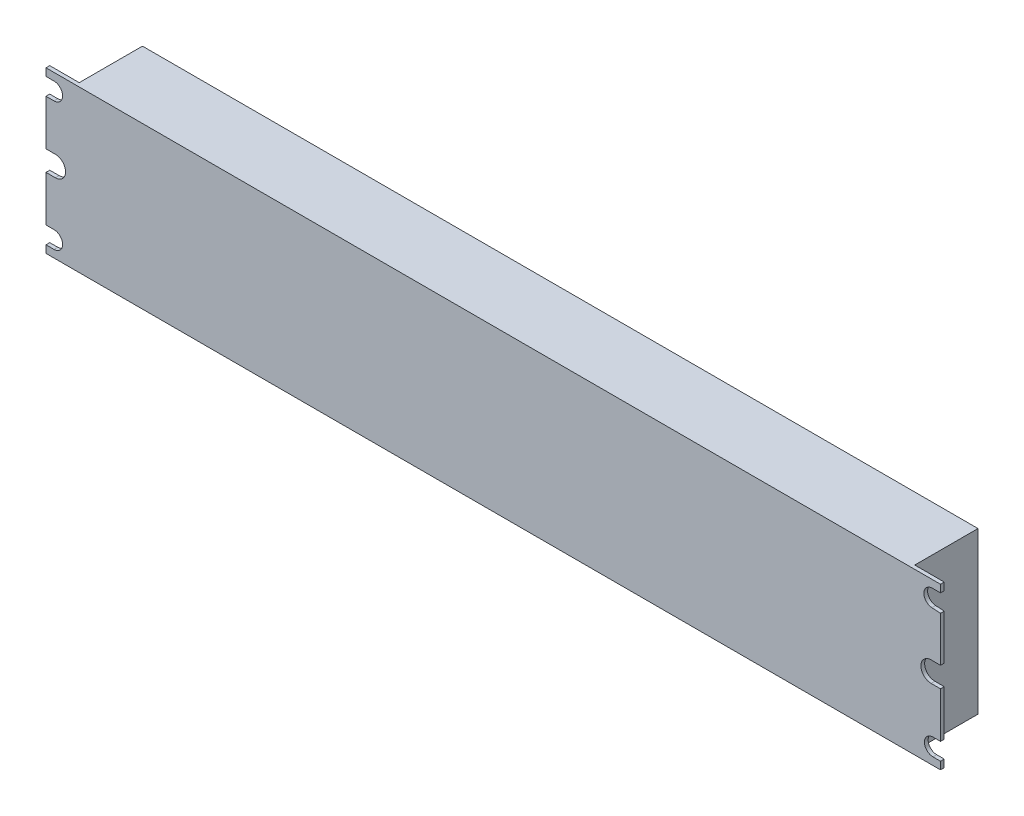
ISO-10303-21;
HEADER;
FILE_DESCRIPTION(('STEP AP214'),'2;1');
FILE_NAME('part.step','',(''),(''),'','','');
FILE_SCHEMA(('AUTOMOTIVE_DESIGN { 1 0 10303 214 1 1 1 1 }'));
ENDSEC;
DATA;
#1=APPLICATION_CONTEXT('core data for automotive mechanical design processes');
#2=APPLICATION_PROTOCOL_DEFINITION('international standard','automotive_design',2000,#1);
#3=PRODUCT_CONTEXT('',#1,'mechanical');
#4=PRODUCT('Part','Part','',(#3));
#5=PRODUCT_RELATED_PRODUCT_CATEGORY('part','',(#4));
#6=PRODUCT_DEFINITION_FORMATION('','',#4);
#7=PRODUCT_DEFINITION_CONTEXT('part definition',#1,'design');
#8=PRODUCT_DEFINITION('design','',#6,#7);
#9=PRODUCT_DEFINITION_SHAPE('','',#8);
#10=(LENGTH_UNIT() NAMED_UNIT(*) SI_UNIT(.MILLI.,.METRE.));
#11=(NAMED_UNIT(*) PLANE_ANGLE_UNIT() SI_UNIT($,.RADIAN.));
#12=(NAMED_UNIT(*) SI_UNIT($,.STERADIAN.) SOLID_ANGLE_UNIT());
#13=UNCERTAINTY_MEASURE_WITH_UNIT(LENGTH_MEASURE(1.E-05),#10,'distance_accuracy_value','');
#14=(GEOMETRIC_REPRESENTATION_CONTEXT(3) GLOBAL_UNCERTAINTY_ASSIGNED_CONTEXT((#13)) GLOBAL_UNIT_ASSIGNED_CONTEXT((#10,
#11,#12)) REPRESENTATION_CONTEXT('',''));
#15=CARTESIAN_POINT('',(0.,0.,0.));
#16=DIRECTION('',(0.,0.,1.));
#17=DIRECTION('',(1.,0.,0.));
#18=AXIS2_PLACEMENT_3D('',#15,#16,#17);
#19=CARTESIAN_POINT('',(419.481,38.1,414.782));
#20=DIRECTION('',(0.,0.,-1.));
#21=DIRECTION('',(-1.,0.,0.));
#22=AXIS2_PLACEMENT_3D('',#19,#20,#21);
#23=CYLINDRICAL_SURFACE('',#22,4.82600000000005);
#24=DIRECTION('',(0.,0.,-1.));
#25=VECTOR('',#24,1.);
#26=CARTESIAN_POINT('',(419.481,33.274,0.));
#27=LINE('',#26,#25);
#28=CARTESIAN_POINT('',(419.481,33.274,0.));
#29=VERTEX_POINT('',#28);
#30=CARTESIAN_POINT('',(419.481,33.274,-1.778));
#31=VERTEX_POINT('',#30);
#32=EDGE_CURVE('E531',#29,#31,#27,.T.);
#33=ORIENTED_EDGE('',*,*,#32,.T.);
#34=CARTESIAN_POINT('',(419.481,38.1,-1.778));
#35=DIRECTION('',(0.,0.,-1.));
#36=DIRECTION('',(-1.,0.,0.));
#37=AXIS2_PLACEMENT_3D('',#34,#35,#36);
#38=CIRCLE('',#37,4.82600000000005);
#39=CARTESIAN_POINT('',(419.481,42.926,-1.778));
#40=VERTEX_POINT('',#39);
#41=EDGE_CURVE('E286',#31,#40,#38,.T.);
#42=ORIENTED_EDGE('',*,*,#41,.T.);
#43=DIRECTION('',(0.,0.,-1.));
#44=VECTOR('',#43,1.);
#45=CARTESIAN_POINT('',(419.481,42.926,0.));
#46=LINE('',#45,#44);
#47=CARTESIAN_POINT('',(419.481,42.926,0.));
#48=VERTEX_POINT('',#47);
#49=EDGE_CURVE('E528',#48,#40,#46,.T.);
#50=ORIENTED_EDGE('',*,*,#49,.F.);
#51=CARTESIAN_POINT('',(419.481,38.1,0.));
#52=DIRECTION('',(0.,0.,-1.));
#53=DIRECTION('',(-1.,0.,0.));
#54=AXIS2_PLACEMENT_3D('',#51,#52,#53);
#55=CIRCLE('',#54,4.82600000000005);
#56=EDGE_CURVE('E342',#29,#48,#55,.T.);
#57=ORIENTED_EDGE('',*,*,#56,.F.);
#58=EDGE_LOOP('',(#33,#42,#50,#57));
#59=FACE_BOUND('',#58,.T.);
#60=ADVANCED_FACE('F41',(#59),#23,.F.);
#61=CARTESIAN_POINT('',(420.37,7.62,414.782));
#62=DIRECTION('',(0.,0.,-1.));
#63=DIRECTION('',(-1.,0.,0.));
#64=AXIS2_PLACEMENT_3D('',#61,#62,#63);
#65=CYLINDRICAL_SURFACE('',#64,4.06400000000002);
#66=DIRECTION('',(0.,0.,-1.));
#67=VECTOR('',#66,1.);
#68=CARTESIAN_POINT('',(420.37,3.55599999999998,0.));
#69=LINE('',#68,#67);
#70=CARTESIAN_POINT('',(420.37,3.55599999999998,0.));
#71=VERTEX_POINT('',#70);
#72=CARTESIAN_POINT('',(420.37,3.55599999999998,-1.778));
#73=VERTEX_POINT('',#72);
#74=EDGE_CURVE('E300',#71,#73,#69,.T.);
#75=ORIENTED_EDGE('',*,*,#74,.T.);
#76=CARTESIAN_POINT('',(420.37,7.62,-1.778));
#77=DIRECTION('',(0.,0.,-1.));
#78=DIRECTION('',(-1.,0.,0.));
#79=AXIS2_PLACEMENT_3D('',#76,#77,#78);
#80=CIRCLE('',#79,4.06400000000002);
#81=CARTESIAN_POINT('',(420.37,11.684,-1.778));
#82=VERTEX_POINT('',#81);
#83=EDGE_CURVE('E49',#73,#82,#80,.T.);
#84=ORIENTED_EDGE('',*,*,#83,.T.);
#85=DIRECTION('',(0.,0.,-1.));
#86=VECTOR('',#85,1.);
#87=CARTESIAN_POINT('',(420.37,11.684,0.));
#88=LINE('',#87,#86);
#89=CARTESIAN_POINT('',(420.37,11.684,0.));
#90=VERTEX_POINT('',#89);
#91=EDGE_CURVE('E298',#90,#82,#88,.T.);
#92=ORIENTED_EDGE('',*,*,#91,.F.);
#93=CARTESIAN_POINT('',(420.37,7.62,0.));
#94=DIRECTION('',(0.,0.,-1.));
#95=DIRECTION('',(-1.,0.,0.));
#96=AXIS2_PLACEMENT_3D('',#93,#94,#95);
#97=CIRCLE('',#96,4.06400000000002);
#98=EDGE_CURVE('E347',#71,#90,#97,.T.);
#99=ORIENTED_EDGE('',*,*,#98,.F.);
#100=EDGE_LOOP('',(#75,#84,#92,#99));
#101=FACE_BOUND('',#100,.T.);
#102=ADVANCED_FACE('F296',(#101),#65,.F.);
#103=CARTESIAN_POINT('',(3.80999999999994,7.62,414.782));
#104=DIRECTION('',(0.,0.,-1.));
#105=DIRECTION('',(-1.,0.,0.));
#106=AXIS2_PLACEMENT_3D('',#103,#104,#105);
#107=CYLINDRICAL_SURFACE('',#106,4.064);
#108=DIRECTION('',(0.,0.,-1.));
#109=VECTOR('',#108,1.);
#110=CARTESIAN_POINT('',(3.80999999999996,11.684,0.));
#111=LINE('',#110,#109);
#112=CARTESIAN_POINT('',(3.80999999999996,11.684,0.));
#113=VERTEX_POINT('',#112);
#114=CARTESIAN_POINT('',(3.80999999999996,11.684,-1.778));
#115=VERTEX_POINT('',#114);
#116=EDGE_CURVE('E479',#113,#115,#111,.T.);
#117=ORIENTED_EDGE('',*,*,#116,.T.);
#118=CARTESIAN_POINT('',(3.80999999999994,7.62,-1.778));
#119=DIRECTION('',(0.,0.,-1.));
#120=DIRECTION('',(-1.,0.,0.));
#121=AXIS2_PLACEMENT_3D('',#118,#119,#120);
#122=CIRCLE('',#121,4.064);
#123=CARTESIAN_POINT('',(3.8099999999999,3.556,-1.778));
#124=VERTEX_POINT('',#123);
#125=EDGE_CURVE('E337',#115,#124,#122,.T.);
#126=ORIENTED_EDGE('',*,*,#125,.T.);
#127=DIRECTION('',(0.,0.,-1.));
#128=VECTOR('',#127,1.);
#129=CARTESIAN_POINT('',(3.8099999999999,3.556,0.));
#130=LINE('',#129,#128);
#131=CARTESIAN_POINT('',(3.80999999999996,3.556,0.));
#132=VERTEX_POINT('',#131);
#133=EDGE_CURVE('E475',#132,#124,#130,.T.);
#134=ORIENTED_EDGE('',*,*,#133,.F.);
#135=CARTESIAN_POINT('',(3.80999999999994,7.62,0.));
#136=DIRECTION('',(0.,0.,-1.));
#137=DIRECTION('',(-1.,0.,0.));
#138=AXIS2_PLACEMENT_3D('',#135,#136,#137);
#139=CIRCLE('',#138,4.064);
#140=EDGE_CURVE('E349',#113,#132,#139,.T.);
#141=ORIENTED_EDGE('',*,*,#140,.F.);
#142=EDGE_LOOP('',(#117,#126,#134,#141));
#143=FACE_BOUND('',#142,.T.);
#144=ADVANCED_FACE('F566',(#143),#107,.F.);
#145=CARTESIAN_POINT('',(4.44499999999994,38.1,414.782));
#146=DIRECTION('',(0.,0.,-1.));
#147=DIRECTION('',(-1.,0.,0.));
#148=AXIS2_PLACEMENT_3D('',#145,#146,#147);
#149=CYLINDRICAL_SURFACE('',#148,4.826);
#150=DIRECTION('',(0.,0.,-1.));
#151=VECTOR('',#150,1.);
#152=CARTESIAN_POINT('',(4.44499999999996,42.926,0.));
#153=LINE('',#152,#151);
#154=CARTESIAN_POINT('',(4.44499999999996,42.926,0.));
#155=VERTEX_POINT('',#154);
#156=CARTESIAN_POINT('',(4.44499999999999,42.926,-1.778));
#157=VERTEX_POINT('',#156);
#158=EDGE_CURVE('E492',#155,#157,#153,.T.);
#159=ORIENTED_EDGE('',*,*,#158,.T.);
#160=CARTESIAN_POINT('',(4.44499999999994,38.1,-1.778));
#161=DIRECTION('',(0.,0.,-1.));
#162=DIRECTION('',(-1.,0.,0.));
#163=AXIS2_PLACEMENT_3D('',#160,#161,#162);
#164=CIRCLE('',#163,4.826);
#165=CARTESIAN_POINT('',(4.44499999999989,33.274,-1.778));
#166=VERTEX_POINT('',#165);
#167=EDGE_CURVE('E333',#157,#166,#164,.T.);
#168=ORIENTED_EDGE('',*,*,#167,.T.);
#169=DIRECTION('',(0.,0.,-1.));
#170=VECTOR('',#169,1.);
#171=CARTESIAN_POINT('',(4.44499999999989,33.274,0.));
#172=LINE('',#171,#170);
#173=CARTESIAN_POINT('',(4.445,33.274,0.));
#174=VERTEX_POINT('',#173);
#175=EDGE_CURVE('E261',#174,#166,#172,.T.);
#176=ORIENTED_EDGE('',*,*,#175,.F.);
#177=CARTESIAN_POINT('',(4.44499999999994,38.1,0.));
#178=DIRECTION('',(0.,0.,-1.));
#179=DIRECTION('',(-1.,0.,0.));
#180=AXIS2_PLACEMENT_3D('',#177,#178,#179);
#181=CIRCLE('',#180,4.826);
#182=EDGE_CURVE('E272',#155,#174,#181,.T.);
#183=ORIENTED_EDGE('',*,*,#182,.F.);
#184=EDGE_LOOP('',(#159,#168,#176,#183));
#185=FACE_BOUND('',#184,.T.);
#186=ADVANCED_FACE('F576',(#185),#149,.F.);
#187=CARTESIAN_POINT('',(3.80999999999994,68.58,414.782));
#188=DIRECTION('',(0.,0.,-1.));
#189=DIRECTION('',(-1.,0.,0.));
#190=AXIS2_PLACEMENT_3D('',#187,#188,#189);
#191=CYLINDRICAL_SURFACE('',#190,4.06399999999999);
#192=DIRECTION('',(0.,0.,-1.));
#193=VECTOR('',#192,1.);
#194=CARTESIAN_POINT('',(3.80999999999985,72.644,0.));
#195=LINE('',#194,#193);
#196=CARTESIAN_POINT('',(3.80999999999985,72.644,0.));
#197=VERTEX_POINT('',#196);
#198=CARTESIAN_POINT('',(3.80999999999994,72.644,-1.778));
#199=VERTEX_POINT('',#198);
#200=EDGE_CURVE('E506',#197,#199,#195,.T.);
#201=ORIENTED_EDGE('',*,*,#200,.T.);
#202=CARTESIAN_POINT('',(3.80999999999994,68.58,-1.778));
#203=DIRECTION('',(0.,0.,-1.));
#204=DIRECTION('',(-1.,0.,0.));
#205=AXIS2_PLACEMENT_3D('',#202,#203,#204);
#206=CIRCLE('',#205,4.06399999999999);
#207=CARTESIAN_POINT('',(3.81,64.516,-1.778));
#208=VERTEX_POINT('',#207);
#209=EDGE_CURVE('E334',#199,#208,#206,.T.);
#210=ORIENTED_EDGE('',*,*,#209,.T.);
#211=DIRECTION('',(0.,0.,-1.));
#212=VECTOR('',#211,1.);
#213=CARTESIAN_POINT('',(3.81,64.516,0.));
#214=LINE('',#213,#212);
#215=CARTESIAN_POINT('',(3.80999999999994,64.516,0.));
#216=VERTEX_POINT('',#215);
#217=EDGE_CURVE('E489',#216,#208,#214,.T.);
#218=ORIENTED_EDGE('',*,*,#217,.F.);
#219=CARTESIAN_POINT('',(3.80999999999994,68.58,0.));
#220=DIRECTION('',(0.,0.,-1.));
#221=DIRECTION('',(-1.,0.,0.));
#222=AXIS2_PLACEMENT_3D('',#219,#220,#221);
#223=CIRCLE('',#222,4.06399999999999);
#224=EDGE_CURVE('E353',#197,#216,#223,.T.);
#225=ORIENTED_EDGE('',*,*,#224,.F.);
#226=EDGE_LOOP('',(#201,#210,#218,#225));
#227=FACE_BOUND('',#226,.T.);
#228=ADVANCED_FACE('F572',(#227),#191,.F.);
#229=CARTESIAN_POINT('',(0.,76.2,0.));
#230=DIRECTION('',(1.,0.,0.));
#231=DIRECTION('',(0.,0.,-1.));
#232=AXIS2_PLACEMENT_3D('',#229,#230,#231);
#233=PLANE('',#232);
#234=DIRECTION('',(0.,-1.,0.));
#235=VECTOR('',#234,1.);
#236=CARTESIAN_POINT('',(0.,76.2,0.));
#237=LINE('',#236,#235);
#238=CARTESIAN_POINT('',(0.,64.516,0.));
#239=VERTEX_POINT('',#238);
#240=CARTESIAN_POINT('',(0.,42.926,0.));
#241=VERTEX_POINT('',#240);
#242=EDGE_CURVE('E277',#239,#241,#237,.T.);
#243=ORIENTED_EDGE('',*,*,#242,.F.);
#244=DIRECTION('',(0.,0.,-1.));
#245=VECTOR('',#244,1.);
#246=CARTESIAN_POINT('',(0.,64.516,0.));
#247=LINE('',#246,#245);
#248=CARTESIAN_POINT('',(0.,64.516,-1.778));
#249=VERTEX_POINT('',#248);
#250=EDGE_CURVE('E493',#239,#249,#247,.T.);
#251=ORIENTED_EDGE('',*,*,#250,.T.);
#252=DIRECTION('',(0.,1.,0.));
#253=VECTOR('',#252,1.);
#254=CARTESIAN_POINT('',(0.,0.,-1.778));
#255=LINE('',#254,#253);
#256=CARTESIAN_POINT('',(0.,42.926,-1.778));
#257=VERTEX_POINT('',#256);
#258=EDGE_CURVE('E384',#257,#249,#255,.T.);
#259=ORIENTED_EDGE('',*,*,#258,.F.);
#260=DIRECTION('',(0.,0.,-1.));
#261=VECTOR('',#260,1.);
#262=CARTESIAN_POINT('',(0.,42.926,0.));
#263=LINE('',#262,#261);
#264=EDGE_CURVE('E499',#241,#257,#263,.T.);
#265=ORIENTED_EDGE('',*,*,#264,.F.);
#266=EDGE_LOOP('',(#243,#251,#259,#265));
#267=FACE_BOUND('',#266,.T.);
#268=ADVANCED_FACE('F575',(#267),#233,.F.);
#269=CARTESIAN_POINT('',(0.,33.2739999999999,0.));
#270=VERTEX_POINT('',#269);
#271=CARTESIAN_POINT('',(0.,11.684,0.));
#272=VERTEX_POINT('',#271);
#273=EDGE_CURVE('E269',#270,#272,#237,.T.);
#274=ORIENTED_EDGE('',*,*,#273,.F.);
#275=DIRECTION('',(0.,0.,-1.));
#276=VECTOR('',#275,1.);
#277=CARTESIAN_POINT('',(0.,33.2739999999999,0.));
#278=LINE('',#277,#276);
#279=CARTESIAN_POINT('',(0.,33.2739999999999,-1.778));
#280=VERTEX_POINT('',#279);
#281=EDGE_CURVE('E249',#270,#280,#278,.T.);
#282=ORIENTED_EDGE('',*,*,#281,.T.);
#283=CARTESIAN_POINT('',(0.,11.684,-1.778));
#284=VERTEX_POINT('',#283);
#285=EDGE_CURVE('E383',#284,#280,#255,.T.);
#286=ORIENTED_EDGE('',*,*,#285,.F.);
#287=DIRECTION('',(0.,0.,-1.));
#288=VECTOR('',#287,1.);
#289=CARTESIAN_POINT('',(0.,11.684,0.));
#290=LINE('',#289,#288);
#291=EDGE_CURVE('E276',#272,#284,#290,.T.);
#292=ORIENTED_EDGE('',*,*,#291,.F.);
#293=EDGE_LOOP('',(#274,#282,#286,#292));
#294=FACE_BOUND('',#293,.T.);
#295=ADVANCED_FACE('F275',(#294),#233,.F.);
#296=CARTESIAN_POINT('',(0.,3.55599999999998,0.));
#297=VERTEX_POINT('',#296);
#298=CARTESIAN_POINT('',(0.,0.,0.));
#299=VERTEX_POINT('',#298);
#300=EDGE_CURVE('E278',#297,#299,#237,.T.);
#301=ORIENTED_EDGE('',*,*,#300,.F.);
#302=DIRECTION('',(0.,0.,-1.));
#303=VECTOR('',#302,1.);
#304=CARTESIAN_POINT('',(0.,3.55599999999998,0.));
#305=LINE('',#304,#303);
#306=CARTESIAN_POINT('',(0.,3.55599999999998,-1.778));
#307=VERTEX_POINT('',#306);
#308=EDGE_CURVE('E454',#297,#307,#305,.T.);
#309=ORIENTED_EDGE('',*,*,#308,.T.);
#310=CARTESIAN_POINT('',(0.,0.,-1.778));
#311=VERTEX_POINT('',#310);
#312=EDGE_CURVE('E379',#311,#307,#255,.T.);
#313=ORIENTED_EDGE('',*,*,#312,.F.);
#314=DIRECTION('',(0.,0.,1.));
#315=VECTOR('',#314,1.);
#316=CARTESIAN_POINT('',(0.,0.,0.));
#317=LINE('',#316,#315);
#318=EDGE_CURVE('E377',#311,#299,#317,.T.);
#319=ORIENTED_EDGE('',*,*,#318,.T.);
#320=EDGE_LOOP('',(#301,#309,#313,#319));
#321=FACE_BOUND('',#320,.T.);
#322=ADVANCED_FACE('F452',(#321),#233,.F.);
#323=CARTESIAN_POINT('',(423.926,76.2,0.));
#324=DIRECTION('',(-1.,0.,0.));
#325=DIRECTION('',(0.,0.,1.));
#326=AXIS2_PLACEMENT_3D('',#323,#324,#325);
#327=PLANE('',#326);
#328=DIRECTION('',(0.,-1.,0.));
#329=VECTOR('',#328,1.);
#330=CARTESIAN_POINT('',(423.926,76.2,0.));
#331=LINE('',#330,#329);
#332=CARTESIAN_POINT('',(423.926,33.274,0.));
#333=VERTEX_POINT('',#332);
#334=CARTESIAN_POINT('',(423.926,11.684,0.));
#335=VERTEX_POINT('',#334);
#336=EDGE_CURVE('E447',#333,#335,#331,.T.);
#337=ORIENTED_EDGE('',*,*,#336,.T.);
#338=DIRECTION('',(0.,0.,-1.));
#339=VECTOR('',#338,1.);
#340=CARTESIAN_POINT('',(423.926,11.684,0.));
#341=LINE('',#340,#339);
#342=CARTESIAN_POINT('',(423.926,11.684,-1.778));
#343=VERTEX_POINT('',#342);
#344=EDGE_CURVE('E321',#335,#343,#341,.T.);
#345=ORIENTED_EDGE('',*,*,#344,.T.);
#346=DIRECTION('',(0.,-1.,0.));
#347=VECTOR('',#346,1.);
#348=CARTESIAN_POINT('',(423.926,76.2,-1.778));
#349=LINE('',#348,#347);
#350=CARTESIAN_POINT('',(423.926,33.274,-1.778));
#351=VERTEX_POINT('',#350);
#352=EDGE_CURVE('E310',#351,#343,#349,.T.);
#353=ORIENTED_EDGE('',*,*,#352,.F.);
#354=DIRECTION('',(0.,0.,-1.));
#355=VECTOR('',#354,1.);
#356=CARTESIAN_POINT('',(423.926,33.274,0.));
#357=LINE('',#356,#355);
#358=EDGE_CURVE('E538',#333,#351,#357,.T.);
#359=ORIENTED_EDGE('',*,*,#358,.F.);
#360=EDGE_LOOP('',(#337,#345,#353,#359));
#361=FACE_BOUND('',#360,.T.);
#362=ADVANCED_FACE('F547',(#361),#327,.F.);
#363=CARTESIAN_POINT('',(423.926,76.2,0.));
#364=VERTEX_POINT('',#363);
#365=CARTESIAN_POINT('',(423.926,72.6360547333585,0.));
#366=VERTEX_POINT('',#365);
#367=EDGE_CURVE('E282',#364,#366,#331,.T.);
#368=ORIENTED_EDGE('',*,*,#367,.T.);
#369=DIRECTION('',(0.,0.,-1.));
#370=VECTOR('',#369,1.);
#371=CARTESIAN_POINT('',(423.926,72.6360547333585,0.));
#372=LINE('',#371,#370);
#373=CARTESIAN_POINT('',(423.926,72.6360547333585,-1.778));
#374=VERTEX_POINT('',#373);
#375=EDGE_CURVE('E327',#366,#374,#372,.T.);
#376=ORIENTED_EDGE('',*,*,#375,.T.);
#377=CARTESIAN_POINT('',(423.926,76.2,-1.778));
#378=VERTEX_POINT('',#377);
#379=EDGE_CURVE('E357',#378,#374,#349,.T.);
#380=ORIENTED_EDGE('',*,*,#379,.F.);
#381=DIRECTION('',(0.,0.,-1.));
#382=VECTOR('',#381,1.);
#383=CARTESIAN_POINT('',(423.926,76.2,0.));
#384=LINE('',#383,#382);
#385=EDGE_CURVE('E402',#364,#378,#384,.T.);
#386=ORIENTED_EDGE('',*,*,#385,.F.);
#387=EDGE_LOOP('',(#368,#376,#380,#386));
#388=FACE_BOUND('',#387,.T.);
#389=ADVANCED_FACE('F803',(#388),#327,.F.);
#390=CARTESIAN_POINT('',(423.926,64.2694477147444,0.));
#391=VERTEX_POINT('',#390);
#392=CARTESIAN_POINT('',(423.926,42.926,0.));
#393=VERTEX_POINT('',#392);
#394=EDGE_CURVE('E557',#391,#393,#331,.T.);
#395=ORIENTED_EDGE('',*,*,#394,.T.);
#396=DIRECTION('',(0.,0.,-1.));
#397=VECTOR('',#396,1.);
#398=CARTESIAN_POINT('',(423.926,42.926,0.));
#399=LINE('',#398,#397);
#400=CARTESIAN_POINT('',(423.926,42.926,-1.778));
#401=VERTEX_POINT('',#400);
#402=EDGE_CURVE('E523',#393,#401,#399,.T.);
#403=ORIENTED_EDGE('',*,*,#402,.T.);
#404=CARTESIAN_POINT('',(423.926,64.2694477147444,-1.778));
#405=VERTEX_POINT('',#404);
#406=EDGE_CURVE('E361',#405,#401,#349,.T.);
#407=ORIENTED_EDGE('',*,*,#406,.F.);
#408=DIRECTION('',(0.,0.,-1.));
#409=VECTOR('',#408,1.);
#410=CARTESIAN_POINT('',(423.926,64.2694477147444,0.));
#411=LINE('',#410,#409);
#412=EDGE_CURVE('E520',#391,#405,#411,.T.);
#413=ORIENTED_EDGE('',*,*,#412,.F.);
#414=EDGE_LOOP('',(#395,#403,#407,#413));
#415=FACE_BOUND('',#414,.T.);
#416=ADVANCED_FACE('F555',(#415),#327,.F.);
#417=CARTESIAN_POINT('',(0.,72.644,-1.778));
#418=VERTEX_POINT('',#417);
#419=CARTESIAN_POINT('',(0.,76.2,-1.778));
#420=VERTEX_POINT('',#419);
#421=EDGE_CURVE('E385',#418,#420,#255,.T.);
#422=ORIENTED_EDGE('',*,*,#421,.F.);
#423=DIRECTION('',(0.,0.,-1.));
#424=VECTOR('',#423,1.);
#425=CARTESIAN_POINT('',(0.,72.644,0.));
#426=LINE('',#425,#424);
#427=CARTESIAN_POINT('',(0.,72.644,0.));
#428=VERTEX_POINT('',#427);
#429=EDGE_CURVE('E512',#428,#418,#426,.T.);
#430=ORIENTED_EDGE('',*,*,#429,.F.);
#431=CARTESIAN_POINT('',(0.,76.2,0.));
#432=VERTEX_POINT('',#431);
#433=EDGE_CURVE('E281',#432,#428,#237,.T.);
#434=ORIENTED_EDGE('',*,*,#433,.F.);
#435=DIRECTION('',(0.,0.,1.));
#436=VECTOR('',#435,1.);
#437=CARTESIAN_POINT('',(0.,76.2,0.));
#438=LINE('',#437,#436);
#439=EDGE_CURVE('E397',#420,#432,#438,.T.);
#440=ORIENTED_EDGE('',*,*,#439,.F.);
#441=EDGE_LOOP('',(#422,#430,#434,#440));
#442=FACE_BOUND('',#441,.T.);
#443=ADVANCED_FACE('F43',(#442),#233,.F.);
#444=CARTESIAN_POINT('',(423.926,3.55599999999998,-1.778));
#445=VERTEX_POINT('',#444);
#446=CARTESIAN_POINT('',(423.926,0.,-1.778));
#447=VERTEX_POINT('',#446);
#448=EDGE_CURVE('E362',#445,#447,#349,.T.);
#449=ORIENTED_EDGE('',*,*,#448,.F.);
#450=DIRECTION('',(0.,0.,-1.));
#451=VECTOR('',#450,1.);
#452=CARTESIAN_POINT('',(423.926,3.55599999999998,0.));
#453=LINE('',#452,#451);
#454=CARTESIAN_POINT('',(423.926,3.55599999999998,0.));
#455=VERTEX_POINT('',#454);
#456=EDGE_CURVE('E317',#455,#445,#453,.T.);
#457=ORIENTED_EDGE('',*,*,#456,.F.);
#458=CARTESIAN_POINT('',(423.926,0.,0.));
#459=VERTEX_POINT('',#458);
#460=EDGE_CURVE('E408',#455,#459,#331,.T.);
#461=ORIENTED_EDGE('',*,*,#460,.T.);
#462=DIRECTION('',(0.,0.,-1.));
#463=VECTOR('',#462,1.);
#464=CARTESIAN_POINT('',(423.926,0.,0.));
#465=LINE('',#464,#463);
#466=EDGE_CURVE('E414',#459,#447,#465,.T.);
#467=ORIENTED_EDGE('',*,*,#466,.T.);
#468=EDGE_LOOP('',(#449,#457,#461,#467));
#469=FACE_BOUND('',#468,.T.);
#470=ADVANCED_FACE('F444',(#469),#327,.F.);
#471=CARTESIAN_POINT('',(0.,76.2,0.));
#472=DIRECTION('',(0.,0.,-1.));
#473=DIRECTION('',(-1.,0.,0.));
#474=AXIS2_PLACEMENT_3D('',#471,#472,#473);
#475=PLANE('',#474);
#476=ORIENTED_EDGE('',*,*,#460,.F.);
#477=DIRECTION('',(-1.,0.,0.));
#478=VECTOR('',#477,1.);
#479=CARTESIAN_POINT('',(420.37,3.55599999999998,0.));
#480=LINE('',#479,#478);
#481=EDGE_CURVE('E504',#455,#71,#480,.T.);
#482=ORIENTED_EDGE('',*,*,#481,.T.);
#483=ORIENTED_EDGE('',*,*,#98,.T.);
#484=DIRECTION('',(1.,0.,0.));
#485=VECTOR('',#484,1.);
#486=CARTESIAN_POINT('',(420.37,11.684,0.));
#487=LINE('',#486,#485);
#488=EDGE_CURVE('E313',#90,#335,#487,.T.);
#489=ORIENTED_EDGE('',*,*,#488,.T.);
#490=ORIENTED_EDGE('',*,*,#336,.F.);
#491=DIRECTION('',(-1.,0.,0.));
#492=VECTOR('',#491,1.);
#493=CARTESIAN_POINT('',(419.481,33.274,0.));
#494=LINE('',#493,#492);
#495=EDGE_CURVE('E535',#333,#29,#494,.T.);
#496=ORIENTED_EDGE('',*,*,#495,.T.);
#497=ORIENTED_EDGE('',*,*,#56,.T.);
#498=DIRECTION('',(1.,0.,0.));
#499=VECTOR('',#498,1.);
#500=CARTESIAN_POINT('',(419.481,42.926,0.));
#501=LINE('',#500,#499);
#502=EDGE_CURVE('E64',#48,#393,#501,.T.);
#503=ORIENTED_EDGE('',*,*,#502,.T.);
#504=ORIENTED_EDGE('',*,*,#394,.F.);
#505=DIRECTION('',(-0.998044963916957,0.0625000000000071,0.));
#506=VECTOR('',#505,1.);
#507=CARTESIAN_POINT('',(419.862,64.5239452666415,0.));
#508=LINE('',#507,#506);
#509=CARTESIAN_POINT('',(419.862,64.5239452666415,0.));
#510=VERTEX_POINT('',#509);
#511=EDGE_CURVE('E517',#391,#510,#508,.T.);
#512=ORIENTED_EDGE('',*,*,#511,.T.);
#513=CARTESIAN_POINT('',(420.116,68.58,0.));
#514=DIRECTION('',(0.,0.,-1.));
#515=DIRECTION('',(-1.,0.,0.));
#516=AXIS2_PLACEMENT_3D('',#513,#514,#515);
#517=CIRCLE('',#516,4.06400000000002);
#518=CARTESIAN_POINT('',(420.37,72.6360547333585,0.));
#519=VERTEX_POINT('',#518);
#520=EDGE_CURVE('E345',#510,#519,#517,.T.);
#521=ORIENTED_EDGE('',*,*,#520,.T.);
#522=DIRECTION('',(1.,0.,0.));
#523=VECTOR('',#522,1.);
#524=CARTESIAN_POINT('',(419.862,72.6360547333585,0.));
#525=LINE('',#524,#523);
#526=EDGE_CURVE('E324',#519,#366,#525,.T.);
#527=ORIENTED_EDGE('',*,*,#526,.T.);
#528=ORIENTED_EDGE('',*,*,#367,.F.);
#529=DIRECTION('',(1.,0.,0.));
#530=VECTOR('',#529,1.);
#531=CARTESIAN_POINT('',(0.,76.2,0.));
#532=LINE('',#531,#530);
#533=EDGE_CURVE('E399',#432,#364,#532,.T.);
#534=ORIENTED_EDGE('',*,*,#533,.F.);
#535=ORIENTED_EDGE('',*,*,#433,.T.);
#536=DIRECTION('',(1.,0.,0.));
#537=VECTOR('',#536,1.);
#538=CARTESIAN_POINT('',(3.80999999999985,72.644,0.));
#539=LINE('',#538,#537);
#540=EDGE_CURVE('E509',#428,#197,#539,.T.);
#541=ORIENTED_EDGE('',*,*,#540,.T.);
#542=ORIENTED_EDGE('',*,*,#224,.T.);
#543=DIRECTION('',(-1.,0.,0.));
#544=VECTOR('',#543,1.);
#545=CARTESIAN_POINT('',(3.81,64.516,0.));
#546=LINE('',#545,#544);
#547=EDGE_CURVE('E486',#216,#239,#546,.T.);
#548=ORIENTED_EDGE('',*,*,#547,.T.);
#549=ORIENTED_EDGE('',*,*,#242,.T.);
#550=DIRECTION('',(1.,0.,0.));
#551=VECTOR('',#550,1.);
#552=CARTESIAN_POINT('',(4.44499999999996,42.926,0.));
#553=LINE('',#552,#551);
#554=EDGE_CURVE('E497',#241,#155,#553,.T.);
#555=ORIENTED_EDGE('',*,*,#554,.T.);
#556=ORIENTED_EDGE('',*,*,#182,.T.);
#557=DIRECTION('',(-1.,0.,0.));
#558=VECTOR('',#557,1.);
#559=CARTESIAN_POINT('',(4.44499999999989,33.274,0.));
#560=LINE('',#559,#558);
#561=EDGE_CURVE('E252',#174,#270,#560,.T.);
#562=ORIENTED_EDGE('',*,*,#561,.T.);
#563=ORIENTED_EDGE('',*,*,#273,.T.);
#564=DIRECTION('',(1.,0.,0.));
#565=VECTOR('',#564,1.);
#566=CARTESIAN_POINT('',(3.80999999999996,11.684,0.));
#567=LINE('',#566,#565);
#568=EDGE_CURVE('E472',#272,#113,#567,.T.);
#569=ORIENTED_EDGE('',*,*,#568,.T.);
#570=ORIENTED_EDGE('',*,*,#140,.T.);
#571=DIRECTION('',(-1.,0.,0.));
#572=VECTOR('',#571,1.);
#573=CARTESIAN_POINT('',(3.8099999999999,3.556,0.));
#574=LINE('',#573,#572);
#575=EDGE_CURVE('E482',#132,#297,#574,.T.);
#576=ORIENTED_EDGE('',*,*,#575,.T.);
#577=ORIENTED_EDGE('',*,*,#300,.T.);
#578=DIRECTION('',(1.,0.,0.));
#579=VECTOR('',#578,1.);
#580=CARTESIAN_POINT('',(0.,0.,0.));
#581=LINE('',#580,#579);
#582=EDGE_CURVE('E411',#299,#459,#581,.T.);
#583=ORIENTED_EDGE('',*,*,#582,.T.);
#584=EDGE_LOOP('',(#476,#482,#483,#489,#490,#496,#497,#503,#504,#512,#521,#527,#528,#534,#535,
#541,#542,#548,#549,#555,#556,#562,#563,#569,#570,#576,#577,#583));
#585=FACE_BOUND('',#584,.T.);
#586=ADVANCED_FACE('F267',(#585),#475,.F.);
#587=CARTESIAN_POINT('',(0.,76.2,-31.75));
#588=DIRECTION('',(0.,0.,1.));
#589=DIRECTION('',(1.,0.,0.));
#590=AXIS2_PLACEMENT_3D('',#587,#588,#589);
#591=PLANE('',#590);
#592=DIRECTION('',(-1.,0.,0.));
#593=VECTOR('',#592,1.);
#594=CARTESIAN_POINT('',(0.,76.2,-31.75));
#595=LINE('',#594,#593);
#596=CARTESIAN_POINT('',(409.956,76.2,-31.75));
#597=VERTEX_POINT('',#596);
#598=CARTESIAN_POINT('',(13.97,76.2,-31.75));
#599=VERTEX_POINT('',#598);
#600=EDGE_CURVE('E405',#597,#599,#595,.T.);
#601=ORIENTED_EDGE('',*,*,#600,.F.);
#602=DIRECTION('',(0.,1.,0.));
#603=VECTOR('',#602,1.);
#604=CARTESIAN_POINT('',(409.956,76.2,-31.75));
#605=LINE('',#604,#603);
#606=CARTESIAN_POINT('',(409.956,0.,-31.75));
#607=VERTEX_POINT('',#606);
#608=EDGE_CURVE('E371',#607,#597,#605,.T.);
#609=ORIENTED_EDGE('',*,*,#608,.F.);
#610=DIRECTION('',(-1.,0.,0.));
#611=VECTOR('',#610,1.);
#612=CARTESIAN_POINT('',(0.,0.,-31.75));
#613=LINE('',#612,#611);
#614=CARTESIAN_POINT('',(13.97,0.,-31.75));
#615=VERTEX_POINT('',#614);
#616=EDGE_CURVE('E400',#607,#615,#613,.T.);
#617=ORIENTED_EDGE('',*,*,#616,.T.);
#618=DIRECTION('',(0.,-1.,0.));
#619=VECTOR('',#618,1.);
#620=CARTESIAN_POINT('',(13.97,0.,-31.75));
#621=LINE('',#620,#619);
#622=EDGE_CURVE('E356',#599,#615,#621,.T.);
#623=ORIENTED_EDGE('',*,*,#622,.F.);
#624=EDGE_LOOP('',(#601,#609,#617,#623));
#625=FACE_BOUND('',#624,.T.);
#626=ADVANCED_FACE('F422',(#625),#591,.F.);
#627=CARTESIAN_POINT('',(0.,76.2,0.));
#628=DIRECTION('',(0.,-1.,0.));
#629=DIRECTION('',(0.,0.,-1.));
#630=AXIS2_PLACEMENT_3D('',#627,#628,#629);
#631=PLANE('',#630);
#632=DIRECTION('',(1.,0.,0.));
#633=VECTOR('',#632,1.);
#634=CARTESIAN_POINT('',(423.926,76.2,-1.778));
#635=LINE('',#634,#633);
#636=CARTESIAN_POINT('',(409.956,76.2,-1.778));
#637=VERTEX_POINT('',#636);
#638=EDGE_CURVE('E368',#637,#378,#635,.T.);
#639=ORIENTED_EDGE('',*,*,#638,.F.);
#640=DIRECTION('',(0.,0.,-1.));
#641=VECTOR('',#640,1.);
#642=CARTESIAN_POINT('',(409.956,76.2,-1.778));
#643=LINE('',#642,#641);
#644=EDGE_CURVE('E374',#637,#597,#643,.T.);
#645=ORIENTED_EDGE('',*,*,#644,.T.);
#646=ORIENTED_EDGE('',*,*,#600,.T.);
#647=DIRECTION('',(0.,0.,-1.));
#648=VECTOR('',#647,1.);
#649=CARTESIAN_POINT('',(13.97,76.2,-1.778));
#650=LINE('',#649,#648);
#651=CARTESIAN_POINT('',(13.97,76.2,-1.778));
#652=VERTEX_POINT('',#651);
#653=EDGE_CURVE('E392',#652,#599,#650,.T.);
#654=ORIENTED_EDGE('',*,*,#653,.F.);
#655=DIRECTION('',(1.,0.,0.));
#656=VECTOR('',#655,1.);
#657=CARTESIAN_POINT('',(0.,76.2,-1.778));
#658=LINE('',#657,#656);
#659=EDGE_CURVE('E382',#420,#652,#658,.T.);
#660=ORIENTED_EDGE('',*,*,#659,.F.);
#661=ORIENTED_EDGE('',*,*,#439,.T.);
#662=ORIENTED_EDGE('',*,*,#533,.T.);
#663=ORIENTED_EDGE('',*,*,#385,.T.);
#664=EDGE_LOOP('',(#639,#645,#646,#654,#660,#661,#662,#663));
#665=FACE_BOUND('',#664,.T.);
#666=ADVANCED_FACE('F436',(#665),#631,.F.);
#667=CARTESIAN_POINT('',(0.,0.,0.));
#668=DIRECTION('',(0.,-1.,0.));
#669=DIRECTION('',(0.,0.,-1.));
#670=AXIS2_PLACEMENT_3D('',#667,#668,#669);
#671=PLANE('',#670);
#672=DIRECTION('',(0.,0.,-1.));
#673=VECTOR('',#672,1.);
#674=CARTESIAN_POINT('',(409.956,0.,-1.778));
#675=LINE('',#674,#673);
#676=CARTESIAN_POINT('',(409.956,0.,-1.778));
#677=VERTEX_POINT('',#676);
#678=EDGE_CURVE('E370',#677,#607,#675,.T.);
#679=ORIENTED_EDGE('',*,*,#678,.F.);
#680=DIRECTION('',(-1.,0.,0.));
#681=VECTOR('',#680,1.);
#682=CARTESIAN_POINT('',(423.926,0.,-1.778));
#683=LINE('',#682,#681);
#684=EDGE_CURVE('E360',#447,#677,#683,.T.);
#685=ORIENTED_EDGE('',*,*,#684,.F.);
#686=ORIENTED_EDGE('',*,*,#466,.F.);
#687=ORIENTED_EDGE('',*,*,#582,.F.);
#688=ORIENTED_EDGE('',*,*,#318,.F.);
#689=DIRECTION('',(-1.,0.,0.));
#690=VECTOR('',#689,1.);
#691=CARTESIAN_POINT('',(0.,0.,-1.778));
#692=LINE('',#691,#690);
#693=CARTESIAN_POINT('',(13.97,0.,-1.778));
#694=VERTEX_POINT('',#693);
#695=EDGE_CURVE('E390',#694,#311,#692,.T.);
#696=ORIENTED_EDGE('',*,*,#695,.F.);
#697=DIRECTION('',(0.,0.,-1.));
#698=VECTOR('',#697,1.);
#699=CARTESIAN_POINT('',(13.97,0.,-1.778));
#700=LINE('',#699,#698);
#701=EDGE_CURVE('E373',#694,#615,#700,.T.);
#702=ORIENTED_EDGE('',*,*,#701,.T.);
#703=ORIENTED_EDGE('',*,*,#616,.F.);
#704=EDGE_LOOP('',(#679,#685,#686,#687,#688,#696,#702,#703));
#705=FACE_BOUND('',#704,.T.);
#706=ADVANCED_FACE('F425',(#705),#671,.T.);
#707=CARTESIAN_POINT('',(13.97,0.,-1.778));
#708=DIRECTION('',(1.,0.,0.));
#709=DIRECTION('',(0.,0.,-1.));
#710=AXIS2_PLACEMENT_3D('',#707,#708,#709);
#711=PLANE('',#710);
#712=ORIENTED_EDGE('',*,*,#622,.T.);
#713=ORIENTED_EDGE('',*,*,#701,.F.);
#714=DIRECTION('',(0.,-1.,0.));
#715=VECTOR('',#714,1.);
#716=CARTESIAN_POINT('',(13.97,0.,-1.778));
#717=LINE('',#716,#715);
#718=EDGE_CURVE('E388',#652,#694,#717,.T.);
#719=ORIENTED_EDGE('',*,*,#718,.F.);
#720=ORIENTED_EDGE('',*,*,#653,.T.);
#721=EDGE_LOOP('',(#712,#713,#719,#720));
#722=FACE_BOUND('',#721,.T.);
#723=ADVANCED_FACE('F431',(#722),#711,.F.);
#724=CARTESIAN_POINT('',(0.,0.,-1.778));
#725=DIRECTION('',(0.,0.,-1.));
#726=DIRECTION('',(-1.,0.,0.));
#727=AXIS2_PLACEMENT_3D('',#724,#725,#726);
#728=PLANE('',#727);
#729=DIRECTION('',(1.,0.,0.));
#730=VECTOR('',#729,1.);
#731=CARTESIAN_POINT('',(3.80999999999985,72.644,-1.778));
#732=LINE('',#731,#730);
#733=EDGE_CURVE('E463',#418,#199,#732,.T.);
#734=ORIENTED_EDGE('',*,*,#733,.F.);
#735=ORIENTED_EDGE('',*,*,#421,.T.);
#736=ORIENTED_EDGE('',*,*,#659,.T.);
#737=ORIENTED_EDGE('',*,*,#718,.T.);
#738=ORIENTED_EDGE('',*,*,#695,.T.);
#739=ORIENTED_EDGE('',*,*,#312,.T.);
#740=DIRECTION('',(-1.,0.,0.));
#741=VECTOR('',#740,1.);
#742=CARTESIAN_POINT('',(3.8099999999999,3.556,-1.778));
#743=LINE('',#742,#741);
#744=EDGE_CURVE('E460',#124,#307,#743,.T.);
#745=ORIENTED_EDGE('',*,*,#744,.F.);
#746=ORIENTED_EDGE('',*,*,#125,.F.);
#747=DIRECTION('',(1.,0.,0.));
#748=VECTOR('',#747,1.);
#749=CARTESIAN_POINT('',(3.80999999999996,11.684,-1.778));
#750=LINE('',#749,#748);
#751=EDGE_CURVE('E469',#284,#115,#750,.T.);
#752=ORIENTED_EDGE('',*,*,#751,.F.);
#753=ORIENTED_EDGE('',*,*,#285,.T.);
#754=DIRECTION('',(-1.,0.,0.));
#755=VECTOR('',#754,1.);
#756=CARTESIAN_POINT('',(4.44499999999989,33.274,-1.778));
#757=LINE('',#756,#755);
#758=EDGE_CURVE('E255',#166,#280,#757,.T.);
#759=ORIENTED_EDGE('',*,*,#758,.F.);
#760=ORIENTED_EDGE('',*,*,#167,.F.);
#761=DIRECTION('',(1.,0.,0.));
#762=VECTOR('',#761,1.);
#763=CARTESIAN_POINT('',(4.44499999999996,42.926,-1.778));
#764=LINE('',#763,#762);
#765=EDGE_CURVE('E260',#257,#157,#764,.T.);
#766=ORIENTED_EDGE('',*,*,#765,.F.);
#767=ORIENTED_EDGE('',*,*,#258,.T.);
#768=DIRECTION('',(-1.,0.,0.));
#769=VECTOR('',#768,1.);
#770=CARTESIAN_POINT('',(3.81,64.516,-1.778));
#771=LINE('',#770,#769);
#772=EDGE_CURVE('E490',#208,#249,#771,.T.);
#773=ORIENTED_EDGE('',*,*,#772,.F.);
#774=ORIENTED_EDGE('',*,*,#209,.F.);
#775=EDGE_LOOP('',(#734,#735,#736,#737,#738,#739,#745,#746,#752,#753,#759,#760,#766,#767,#773,#774));
#776=FACE_BOUND('',#775,.T.);
#777=ADVANCED_FACE('F458',(#776),#728,.T.);
#778=CARTESIAN_POINT('',(409.956,76.2,-1.778));
#779=DIRECTION('',(-1.,0.,0.));
#780=DIRECTION('',(0.,0.,1.));
#781=AXIS2_PLACEMENT_3D('',#778,#779,#780);
#782=PLANE('',#781);
#783=ORIENTED_EDGE('',*,*,#608,.T.);
#784=ORIENTED_EDGE('',*,*,#644,.F.);
#785=DIRECTION('',(0.,1.,0.));
#786=VECTOR('',#785,1.);
#787=CARTESIAN_POINT('',(409.956,76.2,-1.778));
#788=LINE('',#787,#786);
#789=EDGE_CURVE('E365',#677,#637,#788,.T.);
#790=ORIENTED_EDGE('',*,*,#789,.F.);
#791=ORIENTED_EDGE('',*,*,#678,.T.);
#792=EDGE_LOOP('',(#783,#784,#790,#791));
#793=FACE_BOUND('',#792,.T.);
#794=ADVANCED_FACE('F439',(#793),#782,.F.);
#795=CARTESIAN_POINT('',(0.,0.,-1.778));
#796=DIRECTION('',(0.,0.,-1.));
#797=DIRECTION('',(-1.,0.,0.));
#798=AXIS2_PLACEMENT_3D('',#795,#796,#797);
#799=PLANE('',#798);
#800=DIRECTION('',(-1.,0.,0.));
#801=VECTOR('',#800,1.);
#802=CARTESIAN_POINT('',(420.37,3.55599999999998,-1.778));
#803=LINE('',#802,#801);
#804=EDGE_CURVE('E305',#445,#73,#803,.T.);
#805=ORIENTED_EDGE('',*,*,#804,.F.);
#806=ORIENTED_EDGE('',*,*,#448,.T.);
#807=ORIENTED_EDGE('',*,*,#684,.T.);
#808=ORIENTED_EDGE('',*,*,#789,.T.);
#809=ORIENTED_EDGE('',*,*,#638,.T.);
#810=ORIENTED_EDGE('',*,*,#379,.T.);
#811=DIRECTION('',(1.,0.,0.));
#812=VECTOR('',#811,1.);
#813=CARTESIAN_POINT('',(419.862,72.6360547333585,-1.778));
#814=LINE('',#813,#812);
#815=CARTESIAN_POINT('',(420.37,72.6360547333585,-1.778));
#816=VERTEX_POINT('',#815);
#817=EDGE_CURVE('E328',#816,#374,#814,.T.);
#818=ORIENTED_EDGE('',*,*,#817,.F.);
#819=CARTESIAN_POINT('',(420.116,68.58,-1.778));
#820=DIRECTION('',(0.,0.,-1.));
#821=DIRECTION('',(-1.,0.,0.));
#822=AXIS2_PLACEMENT_3D('',#819,#820,#821);
#823=CIRCLE('',#822,4.06400000000002);
#824=CARTESIAN_POINT('',(419.862,64.5239452666415,-1.778));
#825=VERTEX_POINT('',#824);
#826=EDGE_CURVE('E290',#825,#816,#823,.T.);
#827=ORIENTED_EDGE('',*,*,#826,.F.);
#828=DIRECTION('',(-0.998044963916957,0.0625000000000071,0.));
#829=VECTOR('',#828,1.);
#830=CARTESIAN_POINT('',(419.862,64.5239452666415,-1.778));
#831=LINE('',#830,#829);
#832=EDGE_CURVE('E521',#405,#825,#831,.T.);
#833=ORIENTED_EDGE('',*,*,#832,.F.);
#834=ORIENTED_EDGE('',*,*,#406,.T.);
#835=DIRECTION('',(1.,0.,0.));
#836=VECTOR('',#835,1.);
#837=CARTESIAN_POINT('',(419.481,42.926,-1.778));
#838=LINE('',#837,#836);
#839=EDGE_CURVE('E529',#40,#401,#838,.T.);
#840=ORIENTED_EDGE('',*,*,#839,.F.);
#841=ORIENTED_EDGE('',*,*,#41,.F.);
#842=DIRECTION('',(-1.,0.,0.));
#843=VECTOR('',#842,1.);
#844=CARTESIAN_POINT('',(419.481,33.274,-1.778));
#845=LINE('',#844,#843);
#846=EDGE_CURVE('E56',#351,#31,#845,.T.);
#847=ORIENTED_EDGE('',*,*,#846,.F.);
#848=ORIENTED_EDGE('',*,*,#352,.T.);
#849=DIRECTION('',(1.,0.,0.));
#850=VECTOR('',#849,1.);
#851=CARTESIAN_POINT('',(420.37,11.684,-1.778));
#852=LINE('',#851,#850);
#853=EDGE_CURVE('E308',#82,#343,#852,.T.);
#854=ORIENTED_EDGE('',*,*,#853,.F.);
#855=ORIENTED_EDGE('',*,*,#83,.F.);
#856=EDGE_LOOP('',(#805,#806,#807,#808,#809,#810,#818,#827,#833,#834,#840,#841,#847,#848,#854,#855));
#857=FACE_BOUND('',#856,.T.);
#858=ADVANCED_FACE('F304',(#857),#799,.T.);
#859=CARTESIAN_POINT('',(420.116,68.58,414.782));
#860=DIRECTION('',(0.,0.,-1.));
#861=DIRECTION('',(-1.,0.,0.));
#862=AXIS2_PLACEMENT_3D('',#859,#860,#861);
#863=CYLINDRICAL_SURFACE('',#862,4.06400000000002);
#864=ORIENTED_EDGE('',*,*,#826,.T.);
#865=DIRECTION('',(0.,0.,-1.));
#866=VECTOR('',#865,1.);
#867=CARTESIAN_POINT('',(420.37,72.6360547333585,414.782));
#868=LINE('',#867,#866);
#869=EDGE_CURVE('E11',#816,#519,#868,.F.);
#870=ORIENTED_EDGE('',*,*,#869,.T.);
#871=ORIENTED_EDGE('',*,*,#520,.F.);
#872=DIRECTION('',(0.,0.,-1.));
#873=VECTOR('',#872,1.);
#874=CARTESIAN_POINT('',(419.862,64.5239452666415,0.));
#875=LINE('',#874,#873);
#876=EDGE_CURVE('E330',#510,#825,#875,.T.);
#877=ORIENTED_EDGE('',*,*,#876,.T.);
#878=EDGE_LOOP('',(#864,#870,#871,#877));
#879=FACE_BOUND('',#878,.T.);
#880=ADVANCED_FACE('F581',(#879),#863,.F.);
#881=CARTESIAN_POINT('',(3.81,64.516,0.));
#882=DIRECTION('',(0.,-1.,0.));
#883=DIRECTION('',(0.,0.,-1.));
#884=AXIS2_PLACEMENT_3D('',#881,#882,#883);
#885=PLANE('',#884);
#886=ORIENTED_EDGE('',*,*,#772,.T.);
#887=ORIENTED_EDGE('',*,*,#250,.F.);
#888=ORIENTED_EDGE('',*,*,#547,.F.);
#889=ORIENTED_EDGE('',*,*,#217,.T.);
#890=EDGE_LOOP('',(#886,#887,#888,#889));
#891=FACE_BOUND('',#890,.T.);
#892=ADVANCED_FACE('F584',(#891),#885,.F.);
#893=CARTESIAN_POINT('',(3.80999999999985,72.644,0.));
#894=DIRECTION('',(0.,1.,0.));
#895=DIRECTION('',(0.,0.,1.));
#896=AXIS2_PLACEMENT_3D('',#893,#894,#895);
#897=PLANE('',#896);
#898=ORIENTED_EDGE('',*,*,#733,.T.);
#899=ORIENTED_EDGE('',*,*,#200,.F.);
#900=ORIENTED_EDGE('',*,*,#540,.F.);
#901=ORIENTED_EDGE('',*,*,#429,.T.);
#902=EDGE_LOOP('',(#898,#899,#900,#901));
#903=FACE_BOUND('',#902,.T.);
#904=ADVANCED_FACE('F648',(#903),#897,.F.);
#905=CARTESIAN_POINT('',(4.44499999999989,33.274,0.));
#906=DIRECTION('',(0.,-1.,0.));
#907=DIRECTION('',(1.,0.,0.));
#908=AXIS2_PLACEMENT_3D('',#905,#906,#907);
#909=PLANE('',#908);
#910=ORIENTED_EDGE('',*,*,#758,.T.);
#911=ORIENTED_EDGE('',*,*,#281,.F.);
#912=ORIENTED_EDGE('',*,*,#561,.F.);
#913=ORIENTED_EDGE('',*,*,#175,.T.);
#914=EDGE_LOOP('',(#910,#911,#912,#913));
#915=FACE_BOUND('',#914,.T.);
#916=ADVANCED_FACE('F251',(#915),#909,.F.);
#917=CARTESIAN_POINT('',(4.44499999999996,42.926,0.));
#918=DIRECTION('',(0.,1.,0.));
#919=DIRECTION('',(-1.,0.,0.));
#920=AXIS2_PLACEMENT_3D('',#917,#918,#919);
#921=PLANE('',#920);
#922=ORIENTED_EDGE('',*,*,#765,.T.);
#923=ORIENTED_EDGE('',*,*,#158,.F.);
#924=ORIENTED_EDGE('',*,*,#554,.F.);
#925=ORIENTED_EDGE('',*,*,#264,.T.);
#926=EDGE_LOOP('',(#922,#923,#924,#925));
#927=FACE_BOUND('',#926,.T.);
#928=ADVANCED_FACE('F663',(#927),#921,.F.);
#929=CARTESIAN_POINT('',(3.8099999999999,3.556,0.));
#930=DIRECTION('',(0.,-1.,0.));
#931=DIRECTION('',(1.,0.,0.));
#932=AXIS2_PLACEMENT_3D('',#929,#930,#931);
#933=PLANE('',#932);
#934=ORIENTED_EDGE('',*,*,#744,.T.);
#935=ORIENTED_EDGE('',*,*,#308,.F.);
#936=ORIENTED_EDGE('',*,*,#575,.F.);
#937=ORIENTED_EDGE('',*,*,#133,.T.);
#938=EDGE_LOOP('',(#934,#935,#936,#937));
#939=FACE_BOUND('',#938,.T.);
#940=ADVANCED_FACE('F670',(#939),#933,.F.);
#941=CARTESIAN_POINT('',(3.80999999999996,11.684,0.));
#942=DIRECTION('',(0.,1.,0.));
#943=DIRECTION('',(-1.,0.,0.));
#944=AXIS2_PLACEMENT_3D('',#941,#942,#943);
#945=PLANE('',#944);
#946=ORIENTED_EDGE('',*,*,#751,.T.);
#947=ORIENTED_EDGE('',*,*,#116,.F.);
#948=ORIENTED_EDGE('',*,*,#568,.F.);
#949=ORIENTED_EDGE('',*,*,#291,.T.);
#950=EDGE_LOOP('',(#946,#947,#948,#949));
#951=FACE_BOUND('',#950,.T.);
#952=ADVANCED_FACE('F678',(#951),#945,.F.);
#953=CARTESIAN_POINT('',(420.37,11.684,0.));
#954=DIRECTION('',(0.,1.,0.));
#955=DIRECTION('',(-1.,0.,0.));
#956=AXIS2_PLACEMENT_3D('',#953,#954,#955);
#957=PLANE('',#956);
#958=ORIENTED_EDGE('',*,*,#853,.T.);
#959=ORIENTED_EDGE('',*,*,#344,.F.);
#960=ORIENTED_EDGE('',*,*,#488,.F.);
#961=ORIENTED_EDGE('',*,*,#91,.T.);
#962=EDGE_LOOP('',(#958,#959,#960,#961));
#963=FACE_BOUND('',#962,.T.);
#964=ADVANCED_FACE('F686',(#963),#957,.F.);
#965=CARTESIAN_POINT('',(420.37,3.55599999999998,0.));
#966=DIRECTION('',(0.,-1.,0.));
#967=DIRECTION('',(0.,0.,-1.));
#968=AXIS2_PLACEMENT_3D('',#965,#966,#967);
#969=PLANE('',#968);
#970=ORIENTED_EDGE('',*,*,#804,.T.);
#971=ORIENTED_EDGE('',*,*,#74,.F.);
#972=ORIENTED_EDGE('',*,*,#481,.F.);
#973=ORIENTED_EDGE('',*,*,#456,.T.);
#974=EDGE_LOOP('',(#970,#971,#972,#973));
#975=FACE_BOUND('',#974,.T.);
#976=ADVANCED_FACE('F693',(#975),#969,.F.);
#977=CARTESIAN_POINT('',(419.862,72.6360547333585,0.));
#978=DIRECTION('',(0.,1.,0.));
#979=DIRECTION('',(-1.,0.,0.));
#980=AXIS2_PLACEMENT_3D('',#977,#978,#979);
#981=PLANE('',#980);
#982=ORIENTED_EDGE('',*,*,#817,.T.);
#983=ORIENTED_EDGE('',*,*,#375,.F.);
#984=ORIENTED_EDGE('',*,*,#526,.F.);
#985=ORIENTED_EDGE('',*,*,#869,.F.);
#986=EDGE_LOOP('',(#982,#983,#984,#985));
#987=FACE_BOUND('',#986,.T.);
#988=ADVANCED_FACE('F570',(#987),#981,.F.);
#989=CARTESIAN_POINT('',(419.862,64.5239452666415,0.));
#990=DIRECTION('',(-0.0625000000000071,-0.998044963916957,0.));
#991=DIRECTION('',(0.998044963916957,-0.0625000000000071,0.));
#992=AXIS2_PLACEMENT_3D('',#989,#990,#991);
#993=PLANE('',#992);
#994=ORIENTED_EDGE('',*,*,#832,.T.);
#995=ORIENTED_EDGE('',*,*,#876,.F.);
#996=ORIENTED_EDGE('',*,*,#511,.F.);
#997=ORIENTED_EDGE('',*,*,#412,.T.);
#998=EDGE_LOOP('',(#994,#995,#996,#997));
#999=FACE_BOUND('',#998,.T.);
#1000=ADVANCED_FACE('F706',(#999),#993,.F.);
#1001=CARTESIAN_POINT('',(419.481,42.926,0.));
#1002=DIRECTION('',(0.,1.,0.));
#1003=DIRECTION('',(0.,0.,1.));
#1004=AXIS2_PLACEMENT_3D('',#1001,#1002,#1003);
#1005=PLANE('',#1004);
#1006=ORIENTED_EDGE('',*,*,#839,.T.);
#1007=ORIENTED_EDGE('',*,*,#402,.F.);
#1008=ORIENTED_EDGE('',*,*,#502,.F.);
#1009=ORIENTED_EDGE('',*,*,#49,.T.);
#1010=EDGE_LOOP('',(#1006,#1007,#1008,#1009));
#1011=FACE_BOUND('',#1010,.T.);
#1012=ADVANCED_FACE('F558',(#1011),#1005,.F.);
#1013=CARTESIAN_POINT('',(419.481,33.274,0.));
#1014=DIRECTION('',(0.,-1.,0.));
#1015=DIRECTION('',(1.,0.,0.));
#1016=AXIS2_PLACEMENT_3D('',#1013,#1014,#1015);
#1017=PLANE('',#1016);
#1018=ORIENTED_EDGE('',*,*,#846,.T.);
#1019=ORIENTED_EDGE('',*,*,#32,.F.);
#1020=ORIENTED_EDGE('',*,*,#495,.F.);
#1021=ORIENTED_EDGE('',*,*,#358,.T.);
#1022=EDGE_LOOP('',(#1018,#1019,#1020,#1021));
#1023=FACE_BOUND('',#1022,.T.);
#1024=ADVANCED_FACE('F541',(#1023),#1017,.F.);
#1025=CLOSED_SHELL('',(#60,#102,#144,#186,#228,#268,#295,#322,#362,#389,#416,#443,#470,#586,
#626,#666,#706,#723,#777,#794,#858,#880,#892,#904,#916,#928,#940,#952,#964,#976,#988,#1000,
#1012,#1024));
#1026=MANIFOLD_SOLID_BREP('B2',#1025);
#1027=ADVANCED_BREP_SHAPE_REPRESENTATION('',(#18,#1026),#14);
#1028=SHAPE_DEFINITION_REPRESENTATION(#9,#1027);
ENDSEC;
END-ISO-10303-21;
